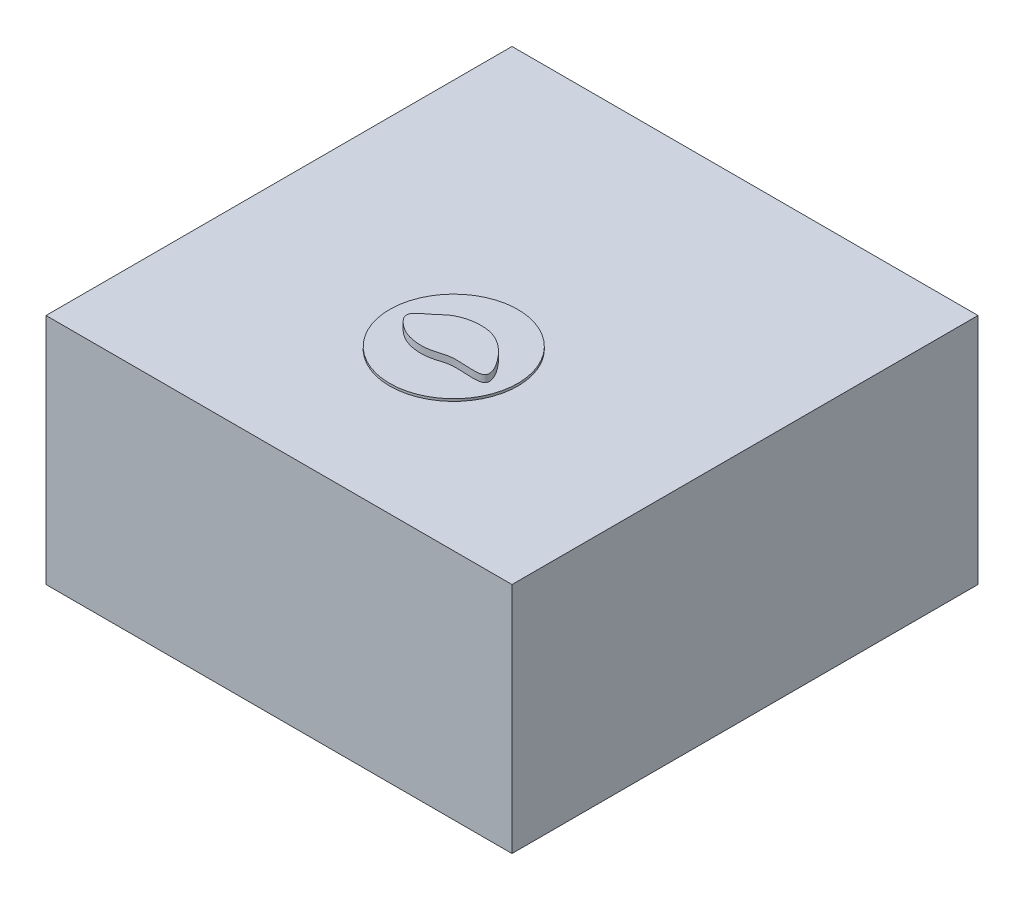
ISO-10303-21;
HEADER;
FILE_DESCRIPTION(('STEP AP214'),'2;1');
FILE_NAME('part.step','',(''),(''),'','','');
FILE_SCHEMA(('AUTOMOTIVE_DESIGN { 1 0 10303 214 1 1 1 1 }'));
ENDSEC;
DATA;
#1=APPLICATION_CONTEXT('core data for automotive mechanical design processes');
#2=APPLICATION_PROTOCOL_DEFINITION('international standard','automotive_design',2000,#1);
#3=PRODUCT_CONTEXT('',#1,'mechanical');
#4=PRODUCT('Part','Part','',(#3));
#5=PRODUCT_RELATED_PRODUCT_CATEGORY('part','',(#4));
#6=PRODUCT_DEFINITION_FORMATION('','',#4);
#7=PRODUCT_DEFINITION_CONTEXT('part definition',#1,'design');
#8=PRODUCT_DEFINITION('design','',#6,#7);
#9=PRODUCT_DEFINITION_SHAPE('','',#8);
#10=(LENGTH_UNIT() NAMED_UNIT(*) SI_UNIT(.MILLI.,.METRE.));
#11=(NAMED_UNIT(*) PLANE_ANGLE_UNIT() SI_UNIT($,.RADIAN.));
#12=(NAMED_UNIT(*) SI_UNIT($,.STERADIAN.) SOLID_ANGLE_UNIT());
#13=UNCERTAINTY_MEASURE_WITH_UNIT(LENGTH_MEASURE(1.E-05),#10,'distance_accuracy_value','');
#14=(GEOMETRIC_REPRESENTATION_CONTEXT(3) GLOBAL_UNCERTAINTY_ASSIGNED_CONTEXT((#13)) GLOBAL_UNIT_ASSIGNED_CONTEXT((#10,
#11,#12)) REPRESENTATION_CONTEXT('',''));
#15=CARTESIAN_POINT('',(0.,0.,0.));
#16=DIRECTION('',(0.,0.,1.));
#17=DIRECTION('',(1.,0.,0.));
#18=AXIS2_PLACEMENT_3D('',#15,#16,#17);
#19=CARTESIAN_POINT('',(-1.32978682457797,5.4,12.0470966404881));
#20=CARTESIAN_POINT('',(-1.56949938233388,5.4,12.2405123536894));
#21=CARTESIAN_POINT('',(-2.08614424851907,5.4,12.5391697720833));
#22=CARTESIAN_POINT('',(-1.58643209411403,5.4,13.1168891119311));
#23=CARTESIAN_POINT('',(-0.99479110722871,5.4,13.4609601521511));
#24=CARTESIAN_POINT('',(-0.122057096544853,5.4,13.5063472457396));
#25=CARTESIAN_POINT('',(0.780549472015395,5.4,13.1044677868928));
#26=CARTESIAN_POINT('',(2.65290980881673,5.4,13.5718372621998));
#27=CARTESIAN_POINT('',(1.37260667116618,5.4,11.7465735610997));
#28=CARTESIAN_POINT('',(0.251281573482777,5.4,11.3225744749199));
#29=CARTESIAN_POINT('',(-0.824147776626976,5.4,11.5489578340658));
#30=CARTESIAN_POINT('',(-1.19634203116918,5.4,11.9394246848268));
#31=CARTESIAN_POINT('',(-1.32978682457797,5.4,12.0470966404881));
#32=B_SPLINE_CURVE_WITH_KNOTS('',3,(#19,#20,#21,#22,#23,#24,#25,#26,#27,#28,#29,#30,#31),
.UNSPECIFIED.,.T.,.F.,(4,1,1,1,1,1,1,1,1,1,4),(0.,0.0890314863366276,0.133435272323839,
0.204833870138696,0.315562123210451,0.38661889368764,0.538438655581061,0.696738525235763,
0.817182112999442,0.95043735542146,1.),.UNSPECIFIED.);
#33=DIRECTION('',(0.,-1.,0.));
#34=VECTOR('',#33,1.);
#35=SURFACE_OF_LINEAR_EXTRUSION('',#32,#34);
#36=CARTESIAN_POINT('',(-1.32978682457797,5.4,12.0470966404881));
#37=VERTEX_POINT('',#36);
#38=EDGE_CURVE('E11',#37,#37,#32,.T.);
#39=ORIENTED_EDGE('',*,*,#38,.F.);
#40=EDGE_LOOP('',(#39));
#41=FACE_BOUND('',#40,.T.);
#42=CARTESIAN_POINT('',(-1.32978682457797,5.1,12.0470966404881));
#43=CARTESIAN_POINT('',(-1.56949938233388,5.1,12.2405123536894));
#44=CARTESIAN_POINT('',(-2.08614424851907,5.1,12.5391697720833));
#45=CARTESIAN_POINT('',(-1.58643209411403,5.1,13.1168891119311));
#46=CARTESIAN_POINT('',(-0.99479110722871,5.1,13.4609601521511));
#47=CARTESIAN_POINT('',(-0.122057096544853,5.1,13.5063472457396));
#48=CARTESIAN_POINT('',(0.780549472015395,5.1,13.1044677868928));
#49=CARTESIAN_POINT('',(2.65290980881673,5.1,13.5718372621998));
#50=CARTESIAN_POINT('',(1.37260667116618,5.1,11.7465735610997));
#51=CARTESIAN_POINT('',(0.251281573482777,5.1,11.3225744749199));
#52=CARTESIAN_POINT('',(-0.824147776626976,5.1,11.5489578340658));
#53=CARTESIAN_POINT('',(-1.19634203116918,5.1,11.9394246848268));
#54=CARTESIAN_POINT('',(-1.32978682457797,5.1,12.0470966404881));
#55=B_SPLINE_CURVE_WITH_KNOTS('',3,(#42,#43,#44,#45,#46,#47,#48,#49,#50,#51,#52,#53,#54),
.UNSPECIFIED.,.T.,.F.,(4,1,1,1,1,1,1,1,1,1,4),(0.,0.0890314863366276,0.133435272323839,
0.204833870138696,0.315562123210451,0.38661889368764,0.538438655581061,0.696738525235763,
0.817182112999442,0.95043735542146,1.),.UNSPECIFIED.);
#56=CARTESIAN_POINT('',(-1.32978682457797,5.1,12.0470966404881));
#57=VERTEX_POINT('',#56);
#58=EDGE_CURVE('E45',#57,#57,#55,.T.);
#59=ORIENTED_EDGE('',*,*,#58,.T.);
#60=EDGE_LOOP('',(#59));
#61=FACE_BOUND('',#60,.T.);
#62=ADVANCED_FACE('F41',(#41,#61),#35,.F.);
#63=CARTESIAN_POINT('',(1.81422588975815,5.4,13.257386496687));
#64=DIRECTION('',(0.,-1.,0.));
#65=DIRECTION('',(0.,0.,-1.));
#66=AXIS2_PLACEMENT_3D('',#63,#64,#65);
#67=PLANE('',#66);
#68=ORIENTED_EDGE('',*,*,#38,.T.);
#69=EDGE_LOOP('',(#68));
#70=FACE_BOUND('',#69,.T.);
#71=ADVANCED_FACE('F64',(#70),#67,.F.);
#72=CARTESIAN_POINT('',(1.81422588975815,5.1,13.257386496687));
#73=DIRECTION('',(0.,-1.,0.));
#74=DIRECTION('',(0.,0.,-1.));
#75=AXIS2_PLACEMENT_3D('',#72,#73,#74);
#76=PLANE('',#75);
#77=ORIENTED_EDGE('',*,*,#58,.F.);
#78=EDGE_LOOP('',(#77));
#79=FACE_BOUND('',#78,.T.);
#80=ADVANCED_FACE('F62',(#79),#76,.T.);
#81=CLOSED_SHELL('',(#62,#71,#80));
#82=MANIFOLD_SOLID_BREP('B2',#81);
#83=CARTESIAN_POINT('',(0.5,5.,12.5));
#84=DIRECTION('',(0.,1.,0.));
#85=DIRECTION('',(0.,0.,1.));
#86=AXIS2_PLACEMENT_3D('',#83,#84,#85);
#87=CYLINDRICAL_SURFACE('',#86,0.00500000000000103);
#88=CARTESIAN_POINT('',(0.5,5.,12.5));
#89=DIRECTION('',(0.,-1.,0.));
#90=DIRECTION('',(0.,0.,1.));
#91=AXIS2_PLACEMENT_3D('',#88,#89,#90);
#92=CIRCLE('',#91,0.00500000000000103);
#93=CARTESIAN_POINT('',(0.5,5.,12.505));
#94=VERTEX_POINT('',#93);
#95=EDGE_CURVE('E40',#94,#94,#92,.T.);
#96=ORIENTED_EDGE('',*,*,#95,.F.);
#97=EDGE_LOOP('',(#96));
#98=FACE_BOUND('',#97,.T.);
#99=CARTESIAN_POINT('',(0.5,5.1,12.5));
#100=DIRECTION('',(0.,-1.,0.));
#101=DIRECTION('',(0.,0.,1.));
#102=AXIS2_PLACEMENT_3D('',#99,#100,#101);
#103=CIRCLE('',#102,0.00500000000000103);
#104=CARTESIAN_POINT('',(0.5,5.1,12.505));
#105=VERTEX_POINT('',#104);
#106=EDGE_CURVE('E103',#105,#105,#103,.T.);
#107=ORIENTED_EDGE('',*,*,#106,.T.);
#108=EDGE_LOOP('',(#107));
#109=FACE_BOUND('',#108,.T.);
#110=ADVANCED_FACE('F100',(#98,#109),#87,.T.);
#111=CARTESIAN_POINT('',(0.5,5.,12.5));
#112=DIRECTION('',(0.,1.,0.));
#113=DIRECTION('',(0.,0.,1.));
#114=AXIS2_PLACEMENT_3D('',#111,#112,#113);
#115=PLANE('',#114);
#116=ORIENTED_EDGE('',*,*,#95,.T.);
#117=EDGE_LOOP('',(#116));
#118=FACE_BOUND('',#117,.T.);
#119=ADVANCED_FACE('F115',(#118),#115,.F.);
#120=CARTESIAN_POINT('',(0.5,5.1,12.5));
#121=DIRECTION('',(0.,1.,0.));
#122=DIRECTION('',(0.,0.,1.));
#123=AXIS2_PLACEMENT_3D('',#120,#121,#122);
#124=PLANE('',#123);
#125=ORIENTED_EDGE('',*,*,#106,.F.);
#126=EDGE_LOOP('',(#125));
#127=FACE_BOUND('',#126,.T.);
#128=ADVANCED_FACE('F113',(#127),#124,.T.);
#129=CLOSED_SHELL('',(#110,#119,#128));
#130=MANIFOLD_SOLID_BREP('B6',#129);
#131=CARTESIAN_POINT('',(0.499999999999998,5.,12.));
#132=DIRECTION('',(0.,1.,0.));
#133=DIRECTION('',(0.,0.,1.));
#134=AXIS2_PLACEMENT_3D('',#131,#132,#133);
#135=CYLINDRICAL_SURFACE('',#134,0.00499999999999896);
#136=CARTESIAN_POINT('',(0.499999999999998,5.,12.));
#137=DIRECTION('',(0.,-1.,0.));
#138=DIRECTION('',(0.,0.,1.));
#139=AXIS2_PLACEMENT_3D('',#136,#137,#138);
#140=CIRCLE('',#139,0.00499999999999896);
#141=CARTESIAN_POINT('',(0.499999999999998,5.,12.005));
#142=VERTEX_POINT('',#141);
#143=EDGE_CURVE('E99',#142,#142,#140,.T.);
#144=ORIENTED_EDGE('',*,*,#143,.F.);
#145=EDGE_LOOP('',(#144));
#146=FACE_BOUND('',#145,.T.);
#147=CARTESIAN_POINT('',(0.499999999999998,5.1,12.));
#148=DIRECTION('',(0.,-1.,0.));
#149=DIRECTION('',(0.,0.,1.));
#150=AXIS2_PLACEMENT_3D('',#147,#148,#149);
#151=CIRCLE('',#150,0.00499999999999896);
#152=CARTESIAN_POINT('',(0.499999999999998,5.1,12.005));
#153=VERTEX_POINT('',#152);
#154=EDGE_CURVE('E151',#153,#153,#151,.T.);
#155=ORIENTED_EDGE('',*,*,#154,.T.);
#156=EDGE_LOOP('',(#155));
#157=FACE_BOUND('',#156,.T.);
#158=ADVANCED_FACE('F148',(#146,#157),#135,.T.);
#159=CARTESIAN_POINT('',(0.499999999999998,5.,12.));
#160=DIRECTION('',(0.,1.,0.));
#161=DIRECTION('',(0.,0.,1.));
#162=AXIS2_PLACEMENT_3D('',#159,#160,#161);
#163=PLANE('',#162);
#164=ORIENTED_EDGE('',*,*,#143,.T.);
#165=EDGE_LOOP('',(#164));
#166=FACE_BOUND('',#165,.T.);
#167=ADVANCED_FACE('F163',(#166),#163,.F.);
#168=CARTESIAN_POINT('',(0.499999999999998,5.1,12.));
#169=DIRECTION('',(0.,1.,0.));
#170=DIRECTION('',(0.,0.,1.));
#171=AXIS2_PLACEMENT_3D('',#168,#169,#170);
#172=PLANE('',#171);
#173=ORIENTED_EDGE('',*,*,#154,.F.);
#174=EDGE_LOOP('',(#173));
#175=FACE_BOUND('',#174,.T.);
#176=ADVANCED_FACE('F161',(#175),#172,.T.);
#177=CLOSED_SHELL('',(#158,#167,#176));
#178=MANIFOLD_SOLID_BREP('B35',#177);
#179=CARTESIAN_POINT('',(0.499999999999998,5.,13.));
#180=DIRECTION('',(0.,1.,0.));
#181=DIRECTION('',(0.,0.,1.));
#182=AXIS2_PLACEMENT_3D('',#179,#180,#181);
#183=CYLINDRICAL_SURFACE('',#182,0.00500000000000103);
#184=CARTESIAN_POINT('',(0.499999999999998,5.,13.));
#185=DIRECTION('',(0.,-1.,0.));
#186=DIRECTION('',(0.,0.,-1.));
#187=AXIS2_PLACEMENT_3D('',#184,#185,#186);
#188=CIRCLE('',#187,0.00500000000000103);
#189=CARTESIAN_POINT('',(0.499999999999998,5.,12.995));
#190=VERTEX_POINT('',#189);
#191=EDGE_CURVE('E147',#190,#190,#188,.T.);
#192=ORIENTED_EDGE('',*,*,#191,.F.);
#193=EDGE_LOOP('',(#192));
#194=FACE_BOUND('',#193,.T.);
#195=CARTESIAN_POINT('',(0.499999999999998,5.1,13.));
#196=DIRECTION('',(0.,-1.,0.));
#197=DIRECTION('',(0.,0.,-1.));
#198=AXIS2_PLACEMENT_3D('',#195,#196,#197);
#199=CIRCLE('',#198,0.00500000000000103);
#200=CARTESIAN_POINT('',(0.499999999999998,5.1,12.995));
#201=VERTEX_POINT('',#200);
#202=EDGE_CURVE('E199',#201,#201,#199,.T.);
#203=ORIENTED_EDGE('',*,*,#202,.T.);
#204=EDGE_LOOP('',(#203));
#205=FACE_BOUND('',#204,.T.);
#206=ADVANCED_FACE('F196',(#194,#205),#183,.T.);
#207=CARTESIAN_POINT('',(0.499999999999998,5.,13.));
#208=DIRECTION('',(0.,-1.,0.));
#209=DIRECTION('',(0.,0.,-1.));
#210=AXIS2_PLACEMENT_3D('',#207,#208,#209);
#211=PLANE('',#210);
#212=ORIENTED_EDGE('',*,*,#191,.T.);
#213=EDGE_LOOP('',(#212));
#214=FACE_BOUND('',#213,.T.);
#215=ADVANCED_FACE('F211',(#214),#211,.T.);
#216=CARTESIAN_POINT('',(0.499999999999998,5.1,13.));
#217=DIRECTION('',(0.,-1.,0.));
#218=DIRECTION('',(0.,0.,-1.));
#219=AXIS2_PLACEMENT_3D('',#216,#217,#218);
#220=PLANE('',#219);
#221=ORIENTED_EDGE('',*,*,#202,.F.);
#222=EDGE_LOOP('',(#221));
#223=FACE_BOUND('',#222,.T.);
#224=ADVANCED_FACE('F209',(#223),#220,.F.);
#225=CLOSED_SHELL('',(#206,#215,#224));
#226=MANIFOLD_SOLID_BREP('B94',#225);
#227=CARTESIAN_POINT('',(0.,5.,13.));
#228=DIRECTION('',(0.,1.,0.));
#229=DIRECTION('',(0.,0.,1.));
#230=AXIS2_PLACEMENT_3D('',#227,#228,#229);
#231=CYLINDRICAL_SURFACE('',#230,0.00500000000000099);
#232=CARTESIAN_POINT('',(0.,5.,13.));
#233=DIRECTION('',(0.,-1.,0.));
#234=DIRECTION('',(0.,0.,1.));
#235=AXIS2_PLACEMENT_3D('',#232,#233,#234);
#236=CIRCLE('',#235,0.00500000000000099);
#237=CARTESIAN_POINT('',(0.,5.,13.005));
#238=VERTEX_POINT('',#237);
#239=EDGE_CURVE('E195',#238,#238,#236,.T.);
#240=ORIENTED_EDGE('',*,*,#239,.F.);
#241=EDGE_LOOP('',(#240));
#242=FACE_BOUND('',#241,.T.);
#243=CARTESIAN_POINT('',(0.,5.1,13.));
#244=DIRECTION('',(0.,-1.,0.));
#245=DIRECTION('',(0.,0.,1.));
#246=AXIS2_PLACEMENT_3D('',#243,#244,#245);
#247=CIRCLE('',#246,0.00500000000000099);
#248=CARTESIAN_POINT('',(0.,5.1,13.005));
#249=VERTEX_POINT('',#248);
#250=EDGE_CURVE('E247',#249,#249,#247,.T.);
#251=ORIENTED_EDGE('',*,*,#250,.T.);
#252=EDGE_LOOP('',(#251));
#253=FACE_BOUND('',#252,.T.);
#254=ADVANCED_FACE('F244',(#242,#253),#231,.T.);
#255=CARTESIAN_POINT('',(0.,5.,13.));
#256=DIRECTION('',(0.,1.,0.));
#257=DIRECTION('',(0.,0.,1.));
#258=AXIS2_PLACEMENT_3D('',#255,#256,#257);
#259=PLANE('',#258);
#260=ORIENTED_EDGE('',*,*,#239,.T.);
#261=EDGE_LOOP('',(#260));
#262=FACE_BOUND('',#261,.T.);
#263=ADVANCED_FACE('F259',(#262),#259,.F.);
#264=CARTESIAN_POINT('',(0.,5.1,13.));
#265=DIRECTION('',(0.,1.,0.));
#266=DIRECTION('',(0.,0.,1.));
#267=AXIS2_PLACEMENT_3D('',#264,#265,#266);
#268=PLANE('',#267);
#269=ORIENTED_EDGE('',*,*,#250,.F.);
#270=EDGE_LOOP('',(#269));
#271=FACE_BOUND('',#270,.T.);
#272=ADVANCED_FACE('F257',(#271),#268,.T.);
#273=CLOSED_SHELL('',(#254,#263,#272));
#274=MANIFOLD_SOLID_BREP('B142',#273);
#275=CARTESIAN_POINT('',(-0.499999999999998,5.,13.));
#276=DIRECTION('',(0.,1.,0.));
#277=DIRECTION('',(0.,0.,1.));
#278=AXIS2_PLACEMENT_3D('',#275,#276,#277);
#279=CYLINDRICAL_SURFACE('',#278,0.00500000000000103);
#280=CARTESIAN_POINT('',(-0.499999999999998,5.,13.));
#281=DIRECTION('',(0.,-1.,0.));
#282=DIRECTION('',(0.,0.,1.));
#283=AXIS2_PLACEMENT_3D('',#280,#281,#282);
#284=CIRCLE('',#283,0.00500000000000103);
#285=CARTESIAN_POINT('',(-0.499999999999998,5.,13.005));
#286=VERTEX_POINT('',#285);
#287=EDGE_CURVE('E243',#286,#286,#284,.T.);
#288=ORIENTED_EDGE('',*,*,#287,.F.);
#289=EDGE_LOOP('',(#288));
#290=FACE_BOUND('',#289,.T.);
#291=CARTESIAN_POINT('',(-0.499999999999998,5.1,13.));
#292=DIRECTION('',(0.,-1.,0.));
#293=DIRECTION('',(0.,0.,1.));
#294=AXIS2_PLACEMENT_3D('',#291,#292,#293);
#295=CIRCLE('',#294,0.00500000000000103);
#296=CARTESIAN_POINT('',(-0.499999999999998,5.1,13.005));
#297=VERTEX_POINT('',#296);
#298=EDGE_CURVE('E295',#297,#297,#295,.T.);
#299=ORIENTED_EDGE('',*,*,#298,.T.);
#300=EDGE_LOOP('',(#299));
#301=FACE_BOUND('',#300,.T.);
#302=ADVANCED_FACE('F292',(#290,#301),#279,.T.);
#303=CARTESIAN_POINT('',(-0.499999999999998,5.,13.));
#304=DIRECTION('',(0.,1.,0.));
#305=DIRECTION('',(0.,0.,1.));
#306=AXIS2_PLACEMENT_3D('',#303,#304,#305);
#307=PLANE('',#306);
#308=ORIENTED_EDGE('',*,*,#287,.T.);
#309=EDGE_LOOP('',(#308));
#310=FACE_BOUND('',#309,.T.);
#311=ADVANCED_FACE('F307',(#310),#307,.F.);
#312=CARTESIAN_POINT('',(-0.499999999999998,5.1,13.));
#313=DIRECTION('',(0.,1.,0.));
#314=DIRECTION('',(0.,0.,1.));
#315=AXIS2_PLACEMENT_3D('',#312,#313,#314);
#316=PLANE('',#315);
#317=ORIENTED_EDGE('',*,*,#298,.F.);
#318=EDGE_LOOP('',(#317));
#319=FACE_BOUND('',#318,.T.);
#320=ADVANCED_FACE('F305',(#319),#316,.T.);
#321=CLOSED_SHELL('',(#302,#311,#320));
#322=MANIFOLD_SOLID_BREP('B190',#321);
#323=CARTESIAN_POINT('',(0.,5.,12.));
#324=DIRECTION('',(0.,1.,0.));
#325=DIRECTION('',(0.,0.,1.));
#326=AXIS2_PLACEMENT_3D('',#323,#324,#325);
#327=CYLINDRICAL_SURFACE('',#326,0.00499999999999898);
#328=CARTESIAN_POINT('',(0.,5.,12.));
#329=DIRECTION('',(0.,-1.,0.));
#330=DIRECTION('',(0.,0.,-1.));
#331=AXIS2_PLACEMENT_3D('',#328,#329,#330);
#332=CIRCLE('',#331,0.00499999999999898);
#333=CARTESIAN_POINT('',(0.,5.,11.995));
#334=VERTEX_POINT('',#333);
#335=EDGE_CURVE('E291',#334,#334,#332,.T.);
#336=ORIENTED_EDGE('',*,*,#335,.F.);
#337=EDGE_LOOP('',(#336));
#338=FACE_BOUND('',#337,.T.);
#339=CARTESIAN_POINT('',(0.,5.1,12.));
#340=DIRECTION('',(0.,-1.,0.));
#341=DIRECTION('',(0.,0.,-1.));
#342=AXIS2_PLACEMENT_3D('',#339,#340,#341);
#343=CIRCLE('',#342,0.00499999999999898);
#344=CARTESIAN_POINT('',(0.,5.1,11.995));
#345=VERTEX_POINT('',#344);
#346=EDGE_CURVE('E343',#345,#345,#343,.T.);
#347=ORIENTED_EDGE('',*,*,#346,.T.);
#348=EDGE_LOOP('',(#347));
#349=FACE_BOUND('',#348,.T.);
#350=ADVANCED_FACE('F340',(#338,#349),#327,.T.);
#351=CARTESIAN_POINT('',(0.,5.,12.));
#352=DIRECTION('',(0.,-1.,0.));
#353=DIRECTION('',(0.,0.,-1.));
#354=AXIS2_PLACEMENT_3D('',#351,#352,#353);
#355=PLANE('',#354);
#356=ORIENTED_EDGE('',*,*,#335,.T.);
#357=EDGE_LOOP('',(#356));
#358=FACE_BOUND('',#357,.T.);
#359=ADVANCED_FACE('F355',(#358),#355,.T.);
#360=CARTESIAN_POINT('',(0.,5.1,12.));
#361=DIRECTION('',(0.,-1.,0.));
#362=DIRECTION('',(0.,0.,-1.));
#363=AXIS2_PLACEMENT_3D('',#360,#361,#362);
#364=PLANE('',#363);
#365=ORIENTED_EDGE('',*,*,#346,.F.);
#366=EDGE_LOOP('',(#365));
#367=FACE_BOUND('',#366,.T.);
#368=ADVANCED_FACE('F353',(#367),#364,.F.);
#369=CLOSED_SHELL('',(#350,#359,#368));
#370=MANIFOLD_SOLID_BREP('B238',#369);
#371=CARTESIAN_POINT('',(-0.499999999999998,5.,12.));
#372=DIRECTION('',(0.,1.,0.));
#373=DIRECTION('',(0.,0.,1.));
#374=AXIS2_PLACEMENT_3D('',#371,#372,#373);
#375=CYLINDRICAL_SURFACE('',#374,0.00499999999999896);
#376=CARTESIAN_POINT('',(-0.499999999999998,5.,12.));
#377=DIRECTION('',(0.,-1.,0.));
#378=DIRECTION('',(0.,0.,-1.));
#379=AXIS2_PLACEMENT_3D('',#376,#377,#378);
#380=CIRCLE('',#379,0.00499999999999896);
#381=CARTESIAN_POINT('',(-0.499999999999998,5.,11.995));
#382=VERTEX_POINT('',#381);
#383=EDGE_CURVE('E339',#382,#382,#380,.T.);
#384=ORIENTED_EDGE('',*,*,#383,.F.);
#385=EDGE_LOOP('',(#384));
#386=FACE_BOUND('',#385,.T.);
#387=CARTESIAN_POINT('',(-0.499999999999998,5.1,12.));
#388=DIRECTION('',(0.,-1.,0.));
#389=DIRECTION('',(0.,0.,-1.));
#390=AXIS2_PLACEMENT_3D('',#387,#388,#389);
#391=CIRCLE('',#390,0.00499999999999896);
#392=CARTESIAN_POINT('',(-0.499999999999998,5.1,11.995));
#393=VERTEX_POINT('',#392);
#394=EDGE_CURVE('E391',#393,#393,#391,.T.);
#395=ORIENTED_EDGE('',*,*,#394,.T.);
#396=EDGE_LOOP('',(#395));
#397=FACE_BOUND('',#396,.T.);
#398=ADVANCED_FACE('F388',(#386,#397),#375,.T.);
#399=CARTESIAN_POINT('',(-0.499999999999998,5.,12.));
#400=DIRECTION('',(0.,-1.,0.));
#401=DIRECTION('',(0.,0.,-1.));
#402=AXIS2_PLACEMENT_3D('',#399,#400,#401);
#403=PLANE('',#402);
#404=ORIENTED_EDGE('',*,*,#383,.T.);
#405=EDGE_LOOP('',(#404));
#406=FACE_BOUND('',#405,.T.);
#407=ADVANCED_FACE('F403',(#406),#403,.T.);
#408=CARTESIAN_POINT('',(-0.499999999999998,5.1,12.));
#409=DIRECTION('',(0.,-1.,0.));
#410=DIRECTION('',(0.,0.,-1.));
#411=AXIS2_PLACEMENT_3D('',#408,#409,#410);
#412=PLANE('',#411);
#413=ORIENTED_EDGE('',*,*,#394,.F.);
#414=EDGE_LOOP('',(#413));
#415=FACE_BOUND('',#414,.T.);
#416=ADVANCED_FACE('F401',(#415),#412,.F.);
#417=CLOSED_SHELL('',(#398,#407,#416));
#418=MANIFOLD_SOLID_BREP('B286',#417);
#419=CARTESIAN_POINT('',(-0.5,5.,12.5));
#420=DIRECTION('',(0.,1.,0.));
#421=DIRECTION('',(0.,0.,1.));
#422=AXIS2_PLACEMENT_3D('',#419,#420,#421);
#423=CYLINDRICAL_SURFACE('',#422,0.00500000000000103);
#424=CARTESIAN_POINT('',(-0.5,5.,12.5));
#425=DIRECTION('',(0.,-1.,0.));
#426=DIRECTION('',(0.,0.,-1.));
#427=AXIS2_PLACEMENT_3D('',#424,#425,#426);
#428=CIRCLE('',#427,0.00500000000000103);
#429=CARTESIAN_POINT('',(-0.5,5.,12.495));
#430=VERTEX_POINT('',#429);
#431=EDGE_CURVE('E387',#430,#430,#428,.T.);
#432=ORIENTED_EDGE('',*,*,#431,.F.);
#433=EDGE_LOOP('',(#432));
#434=FACE_BOUND('',#433,.T.);
#435=CARTESIAN_POINT('',(-0.5,5.1,12.5));
#436=DIRECTION('',(0.,-1.,0.));
#437=DIRECTION('',(0.,0.,-1.));
#438=AXIS2_PLACEMENT_3D('',#435,#436,#437);
#439=CIRCLE('',#438,0.00500000000000103);
#440=CARTESIAN_POINT('',(-0.5,5.1,12.495));
#441=VERTEX_POINT('',#440);
#442=EDGE_CURVE('E439',#441,#441,#439,.T.);
#443=ORIENTED_EDGE('',*,*,#442,.T.);
#444=EDGE_LOOP('',(#443));
#445=FACE_BOUND('',#444,.T.);
#446=ADVANCED_FACE('F436',(#434,#445),#423,.T.);
#447=CARTESIAN_POINT('',(-0.5,5.,12.5));
#448=DIRECTION('',(0.,-1.,0.));
#449=DIRECTION('',(0.,0.,-1.));
#450=AXIS2_PLACEMENT_3D('',#447,#448,#449);
#451=PLANE('',#450);
#452=ORIENTED_EDGE('',*,*,#431,.T.);
#453=EDGE_LOOP('',(#452));
#454=FACE_BOUND('',#453,.T.);
#455=ADVANCED_FACE('F451',(#454),#451,.T.);
#456=CARTESIAN_POINT('',(-0.5,5.1,12.5));
#457=DIRECTION('',(0.,-1.,0.));
#458=DIRECTION('',(0.,0.,-1.));
#459=AXIS2_PLACEMENT_3D('',#456,#457,#458);
#460=PLANE('',#459);
#461=ORIENTED_EDGE('',*,*,#442,.F.);
#462=EDGE_LOOP('',(#461));
#463=FACE_BOUND('',#462,.T.);
#464=ADVANCED_FACE('F449',(#463),#460,.F.);
#465=CLOSED_SHELL('',(#446,#455,#464));
#466=MANIFOLD_SOLID_BREP('B334',#465);
#467=CARTESIAN_POINT('',(0.,5.,12.5));
#468=DIRECTION('',(0.,1.,0.));
#469=DIRECTION('',(0.,0.,1.));
#470=AXIS2_PLACEMENT_3D('',#467,#468,#469);
#471=CYLINDRICAL_SURFACE('',#470,0.00500000000000099);
#472=CARTESIAN_POINT('',(0.,5.,12.5));
#473=DIRECTION('',(0.,-1.,0.));
#474=DIRECTION('',(0.,0.,-1.));
#475=AXIS2_PLACEMENT_3D('',#472,#473,#474);
#476=CIRCLE('',#475,0.00500000000000099);
#477=CARTESIAN_POINT('',(0.,5.,12.495));
#478=VERTEX_POINT('',#477);
#479=EDGE_CURVE('E435',#478,#478,#476,.T.);
#480=ORIENTED_EDGE('',*,*,#479,.F.);
#481=EDGE_LOOP('',(#480));
#482=FACE_BOUND('',#481,.T.);
#483=CARTESIAN_POINT('',(0.,5.1,12.5));
#484=DIRECTION('',(0.,-1.,0.));
#485=DIRECTION('',(0.,0.,-1.));
#486=AXIS2_PLACEMENT_3D('',#483,#484,#485);
#487=CIRCLE('',#486,0.00500000000000099);
#488=CARTESIAN_POINT('',(0.,5.1,12.495));
#489=VERTEX_POINT('',#488);
#490=EDGE_CURVE('E487',#489,#489,#487,.T.);
#491=ORIENTED_EDGE('',*,*,#490,.T.);
#492=EDGE_LOOP('',(#491));
#493=FACE_BOUND('',#492,.T.);
#494=ADVANCED_FACE('F484',(#482,#493),#471,.T.);
#495=CARTESIAN_POINT('',(0.,5.,12.5));
#496=DIRECTION('',(0.,-1.,0.));
#497=DIRECTION('',(0.,0.,-1.));
#498=AXIS2_PLACEMENT_3D('',#495,#496,#497);
#499=PLANE('',#498);
#500=ORIENTED_EDGE('',*,*,#479,.T.);
#501=EDGE_LOOP('',(#500));
#502=FACE_BOUND('',#501,.T.);
#503=ADVANCED_FACE('F499',(#502),#499,.T.);
#504=CARTESIAN_POINT('',(0.,5.1,12.5));
#505=DIRECTION('',(0.,-1.,0.));
#506=DIRECTION('',(0.,0.,-1.));
#507=AXIS2_PLACEMENT_3D('',#504,#505,#506);
#508=PLANE('',#507);
#509=ORIENTED_EDGE('',*,*,#490,.F.);
#510=EDGE_LOOP('',(#509));
#511=FACE_BOUND('',#510,.T.);
#512=ADVANCED_FACE('F497',(#511),#508,.F.);
#513=CLOSED_SHELL('',(#494,#503,#512));
#514=MANIFOLD_SOLID_BREP('B382',#513);
#515=CARTESIAN_POINT('',(0.,5.1,12.5));
#516=DIRECTION('',(0.,-1.,0.));
#517=DIRECTION('',(0.,0.,-1.));
#518=AXIS2_PLACEMENT_3D('',#515,#516,#517);
#519=CYLINDRICAL_SURFACE('',#518,2.75);
#520=CARTESIAN_POINT('',(0.,5.1,12.5));
#521=DIRECTION('',(0.,1.,0.));
#522=DIRECTION('',(0.,0.,1.));
#523=AXIS2_PLACEMENT_3D('',#520,#521,#522);
#524=CIRCLE('',#523,2.75);
#525=CARTESIAN_POINT('',(0.,5.1,15.25));
#526=VERTEX_POINT('',#525);
#527=EDGE_CURVE('E483',#526,#526,#524,.T.);
#528=ORIENTED_EDGE('',*,*,#527,.F.);
#529=EDGE_LOOP('',(#528));
#530=FACE_BOUND('',#529,.T.);
#531=CARTESIAN_POINT('',(0.,5.,12.5));
#532=DIRECTION('',(0.,1.,0.));
#533=DIRECTION('',(0.,0.,1.));
#534=AXIS2_PLACEMENT_3D('',#531,#532,#533);
#535=CIRCLE('',#534,2.75);
#536=CARTESIAN_POINT('',(0.,5.,15.25));
#537=VERTEX_POINT('',#536);
#538=EDGE_CURVE('E535',#537,#537,#535,.T.);
#539=ORIENTED_EDGE('',*,*,#538,.T.);
#540=EDGE_LOOP('',(#539));
#541=FACE_BOUND('',#540,.T.);
#542=ADVANCED_FACE('F532',(#530,#541),#519,.T.);
#543=CARTESIAN_POINT('',(0.,5.1,12.5));
#544=DIRECTION('',(0.,1.,0.));
#545=DIRECTION('',(0.,0.,1.));
#546=AXIS2_PLACEMENT_3D('',#543,#544,#545);
#547=PLANE('',#546);
#548=ORIENTED_EDGE('',*,*,#527,.T.);
#549=EDGE_LOOP('',(#548));
#550=FACE_BOUND('',#549,.T.);
#551=ADVANCED_FACE('F547',(#550),#547,.T.);
#552=CARTESIAN_POINT('',(0.,5.,12.5));
#553=DIRECTION('',(0.,1.,0.));
#554=DIRECTION('',(0.,0.,1.));
#555=AXIS2_PLACEMENT_3D('',#552,#553,#554);
#556=PLANE('',#555);
#557=ORIENTED_EDGE('',*,*,#538,.F.);
#558=EDGE_LOOP('',(#557));
#559=FACE_BOUND('',#558,.T.);
#560=ADVANCED_FACE('F545',(#559),#556,.F.);
#561=CLOSED_SHELL('',(#542,#551,#560));
#562=MANIFOLD_SOLID_BREP('B430',#561);
#563=CARTESIAN_POINT('',(7.5,4.,20.));
#564=DIRECTION('',(0.,0.,-1.));
#565=DIRECTION('',(-1.,0.,0.));
#566=AXIS2_PLACEMENT_3D('',#563,#564,#565);
#567=PLANE('',#566);
#568=CARTESIAN_POINT('',(7.5,4.,20.));
#569=DIRECTION('',(0.,0.,1.));
#570=DIRECTION('',(-1.,0.,0.));
#571=AXIS2_PLACEMENT_3D('',#568,#569,#570);
#572=CIRCLE('',#571,0.500000000000004);
#573=CARTESIAN_POINT('',(6.99999999999999,4.,20.));
#574=VERTEX_POINT('',#573);
#575=EDGE_CURVE('E590',#574,#574,#572,.T.);
#576=ORIENTED_EDGE('',*,*,#575,.T.);
#577=EDGE_LOOP('',(#576));
#578=FACE_BOUND('',#577,.T.);
#579=ADVANCED_FACE('F580',(#578),#567,.F.);
#580=CARTESIAN_POINT('',(7.5,5.,4.));
#581=DIRECTION('',(0.,1.,0.));
#582=DIRECTION('',(-1.,0.,0.));
#583=AXIS2_PLACEMENT_3D('',#580,#581,#582);
#584=PLANE('',#583);
#585=CARTESIAN_POINT('',(7.5,5.,4.));
#586=DIRECTION('',(0.,-1.,0.));
#587=DIRECTION('',(-1.,0.,0.));
#588=AXIS2_PLACEMENT_3D('',#585,#586,#587);
#589=CIRCLE('',#588,0.500000000000004);
#590=CARTESIAN_POINT('',(7.5,5.,3.5));
#591=VERTEX_POINT('',#590);
#592=EDGE_CURVE('E531',#591,#591,#589,.T.);
#593=ORIENTED_EDGE('',*,*,#592,.F.);
#594=EDGE_LOOP('',(#593));
#595=FACE_BOUND('',#594,.T.);
#596=ADVANCED_FACE('F601',(#595),#584,.T.);
#597=CARTESIAN_POINT('',(7.5,4.,20.));
#598=DIRECTION('',(0.,0.,-1.));
#599=DIRECTION('',(-1.,0.,0.));
#600=AXIS2_PLACEMENT_3D('',#597,#598,#599);
#601=CYLINDRICAL_SURFACE('',#600,0.500000000000004);
#602=CARTESIAN_POINT('',(7.5,4.,5.));
#603=DIRECTION('',(0.,0.,1.));
#604=DIRECTION('',(-1.,0.,0.));
#605=AXIS2_PLACEMENT_3D('',#602,#603,#604);
#606=CIRCLE('',#605,0.500000000000004);
#607=CARTESIAN_POINT('',(7.5,3.5,5.));
#608=VERTEX_POINT('',#607);
#609=EDGE_CURVE('E586',#608,#608,#606,.T.);
#610=ORIENTED_EDGE('',*,*,#609,.T.);
#611=EDGE_LOOP('',(#610));
#612=FACE_BOUND('',#611,.T.);
#613=ORIENTED_EDGE('',*,*,#575,.F.);
#614=EDGE_LOOP('',(#613));
#615=FACE_BOUND('',#614,.T.);
#616=ADVANCED_FACE('F598',(#612,#615),#601,.T.);
#617=CARTESIAN_POINT('',(7.5,5.,5.));
#618=DIRECTION('',(1.,0.,0.));
#619=DIRECTION('',(0.,0.,-1.));
#620=AXIS2_PLACEMENT_3D('',#617,#618,#619);
#621=TOROIDAL_SURFACE('',#620,0.999999999999998,0.500000000000004);
#622=CARTESIAN_POINT('',(7.5,5.,5.));
#623=DIRECTION('',(1.,0.,0.));
#624=DIRECTION('',(0.,0.,-1.));
#625=AXIS2_PLACEMENT_3D('',#622,#623,#624);
#626=CIRCLE('',#625,1.5);
#627=EDGE_CURVE('',#608,#591,#626,.T.);
#628=ORIENTED_EDGE('',*,*,#609,.F.);
#629=ORIENTED_EDGE('',*,*,#592,.T.);
#630=ORIENTED_EDGE('',*,*,#627,.T.);
#631=ORIENTED_EDGE('',*,*,#627,.F.);
#632=EDGE_LOOP('',(#628,#630,#629,#631));
#633=FACE_BOUND('',#632,.T.);
#634=ADVANCED_FACE('F600',(#633),#621,.T.);
#635=CLOSED_SHELL('',(#579,#596,#616,#634));
#636=MANIFOLD_SOLID_BREP('B478',#635);
#637=CARTESIAN_POINT('',(-7.5,4.,20.));
#638=DIRECTION('',(0.,0.,1.));
#639=DIRECTION('',(1.,0.,0.));
#640=AXIS2_PLACEMENT_3D('',#637,#638,#639);
#641=PLANE('',#640);
#642=CARTESIAN_POINT('',(-7.5,4.,20.));
#643=DIRECTION('',(0.,0.,1.));
#644=DIRECTION('',(1.,0.,0.));
#645=AXIS2_PLACEMENT_3D('',#642,#643,#644);
#646=CIRCLE('',#645,0.500000000000002);
#647=CARTESIAN_POINT('',(-7.,4.,20.));
#648=VERTEX_POINT('',#647);
#649=EDGE_CURVE('E654',#648,#648,#646,.T.);
#650=ORIENTED_EDGE('',*,*,#649,.T.);
#651=EDGE_LOOP('',(#650));
#652=FACE_BOUND('',#651,.T.);
#653=ADVANCED_FACE('F644',(#652),#641,.T.);
#654=CARTESIAN_POINT('',(-7.5,5.,4.));
#655=DIRECTION('',(0.,-1.,0.));
#656=DIRECTION('',(1.,0.,0.));
#657=AXIS2_PLACEMENT_3D('',#654,#655,#656);
#658=PLANE('',#657);
#659=CARTESIAN_POINT('',(-7.5,5.,4.));
#660=DIRECTION('',(0.,-1.,0.));
#661=DIRECTION('',(1.,0.,0.));
#662=AXIS2_PLACEMENT_3D('',#659,#660,#661);
#663=CIRCLE('',#662,0.500000000000002);
#664=CARTESIAN_POINT('',(-7.5,5.,3.5));
#665=VERTEX_POINT('',#664);
#666=EDGE_CURVE('E579',#665,#665,#663,.T.);
#667=ORIENTED_EDGE('',*,*,#666,.F.);
#668=EDGE_LOOP('',(#667));
#669=FACE_BOUND('',#668,.T.);
#670=ADVANCED_FACE('F665',(#669),#658,.F.);
#671=CARTESIAN_POINT('',(-7.5,4.,20.));
#672=DIRECTION('',(0.,0.,-1.));
#673=DIRECTION('',(-1.,0.,0.));
#674=AXIS2_PLACEMENT_3D('',#671,#672,#673);
#675=CYLINDRICAL_SURFACE('',#674,0.500000000000002);
#676=CARTESIAN_POINT('',(-7.5,4.,5.));
#677=DIRECTION('',(0.,0.,1.));
#678=DIRECTION('',(1.,0.,0.));
#679=AXIS2_PLACEMENT_3D('',#676,#677,#678);
#680=CIRCLE('',#679,0.500000000000002);
#681=CARTESIAN_POINT('',(-7.5,3.5,5.));
#682=VERTEX_POINT('',#681);
#683=EDGE_CURVE('E650',#682,#682,#680,.T.);
#684=ORIENTED_EDGE('',*,*,#683,.T.);
#685=EDGE_LOOP('',(#684));
#686=FACE_BOUND('',#685,.T.);
#687=ORIENTED_EDGE('',*,*,#649,.F.);
#688=EDGE_LOOP('',(#687));
#689=FACE_BOUND('',#688,.T.);
#690=ADVANCED_FACE('F662',(#686,#689),#675,.T.);
#691=CARTESIAN_POINT('',(-7.5,5.,5.));
#692=DIRECTION('',(1.,0.,0.));
#693=DIRECTION('',(0.,0.,-1.));
#694=AXIS2_PLACEMENT_3D('',#691,#692,#693);
#695=TOROIDAL_SURFACE('',#694,1.,0.500000000000002);
#696=CARTESIAN_POINT('',(-7.5,5.,5.));
#697=DIRECTION('',(1.,0.,0.));
#698=DIRECTION('',(0.,0.,-1.));
#699=AXIS2_PLACEMENT_3D('',#696,#697,#698);
#700=CIRCLE('',#699,1.5);
#701=EDGE_CURVE('',#682,#665,#700,.T.);
#702=ORIENTED_EDGE('',*,*,#683,.F.);
#703=ORIENTED_EDGE('',*,*,#666,.T.);
#704=ORIENTED_EDGE('',*,*,#701,.T.);
#705=ORIENTED_EDGE('',*,*,#701,.F.);
#706=EDGE_LOOP('',(#702,#704,#703,#705));
#707=FACE_BOUND('',#706,.T.);
#708=ADVANCED_FACE('F664',(#707),#695,.T.);
#709=CLOSED_SHELL('',(#653,#670,#690,#708));
#710=MANIFOLD_SOLID_BREP('B526',#709);
#711=CARTESIAN_POINT('',(10.,-5.,20.));
#712=DIRECTION('',(-1.,0.,0.));
#713=DIRECTION('',(0.,0.,1.));
#714=AXIS2_PLACEMENT_3D('',#711,#712,#713);
#715=PLANE('',#714);
#716=DIRECTION('',(0.,1.,0.));
#717=VECTOR('',#716,1.);
#718=CARTESIAN_POINT('',(10.,-5.,0.));
#719=LINE('',#718,#717);
#720=CARTESIAN_POINT('',(10.,-5.,0.));
#721=VERTEX_POINT('',#720);
#722=CARTESIAN_POINT('',(10.,5.,0.));
#723=VERTEX_POINT('',#722);
#724=EDGE_CURVE('E762',#721,#723,#719,.T.);
#725=ORIENTED_EDGE('',*,*,#724,.T.);
#726=DIRECTION('',(0.,0.,-1.));
#727=VECTOR('',#726,1.);
#728=CARTESIAN_POINT('',(10.,5.,20.));
#729=LINE('',#728,#727);
#730=CARTESIAN_POINT('',(10.,5.,20.));
#731=VERTEX_POINT('',#730);
#732=EDGE_CURVE('E642',#731,#723,#729,.T.);
#733=ORIENTED_EDGE('',*,*,#732,.F.);
#734=DIRECTION('',(0.,1.,0.));
#735=VECTOR('',#734,1.);
#736=CARTESIAN_POINT('',(10.,-5.,20.));
#737=LINE('',#736,#735);
#738=CARTESIAN_POINT('',(10.,-5.,20.));
#739=VERTEX_POINT('',#738);
#740=EDGE_CURVE('E750',#739,#731,#737,.T.);
#741=ORIENTED_EDGE('',*,*,#740,.F.);
#742=DIRECTION('',(0.,0.,-1.));
#743=VECTOR('',#742,1.);
#744=CARTESIAN_POINT('',(10.,-5.,20.));
#745=LINE('',#744,#743);
#746=EDGE_CURVE('E758',#739,#721,#745,.T.);
#747=ORIENTED_EDGE('',*,*,#746,.T.);
#748=EDGE_LOOP('',(#725,#733,#741,#747));
#749=FACE_BOUND('',#748,.T.);
#750=ADVANCED_FACE('F699',(#749),#715,.F.);
#751=CARTESIAN_POINT('',(-10.,5.,20.));
#752=DIRECTION('',(0.,-1.,0.));
#753=DIRECTION('',(0.,0.,-1.));
#754=AXIS2_PLACEMENT_3D('',#751,#752,#753);
#755=PLANE('',#754);
#756=DIRECTION('',(-1.,0.,0.));
#757=VECTOR('',#756,1.);
#758=CARTESIAN_POINT('',(-10.,5.,0.));
#759=LINE('',#758,#757);
#760=CARTESIAN_POINT('',(-10.,5.,0.));
#761=VERTEX_POINT('',#760);
#762=EDGE_CURVE('E754',#723,#761,#759,.T.);
#763=ORIENTED_EDGE('',*,*,#762,.T.);
#764=DIRECTION('',(0.,0.,-1.));
#765=VECTOR('',#764,1.);
#766=CARTESIAN_POINT('',(-10.,5.,20.));
#767=LINE('',#766,#765);
#768=CARTESIAN_POINT('',(-10.,5.,20.));
#769=VERTEX_POINT('',#768);
#770=EDGE_CURVE('E707',#769,#761,#767,.T.);
#771=ORIENTED_EDGE('',*,*,#770,.F.);
#772=DIRECTION('',(-1.,0.,0.));
#773=VECTOR('',#772,1.);
#774=CARTESIAN_POINT('',(-10.,5.,20.));
#775=LINE('',#774,#773);
#776=EDGE_CURVE('E745',#731,#769,#775,.T.);
#777=ORIENTED_EDGE('',*,*,#776,.F.);
#778=ORIENTED_EDGE('',*,*,#732,.T.);
#779=EDGE_LOOP('',(#763,#771,#777,#778));
#780=FACE_BOUND('',#779,.T.);
#781=ADVANCED_FACE('F753',(#780),#755,.F.);
#782=CARTESIAN_POINT('',(-10.,-5.,20.));
#783=DIRECTION('',(1.,0.,0.));
#784=DIRECTION('',(0.,1.,0.));
#785=AXIS2_PLACEMENT_3D('',#782,#783,#784);
#786=PLANE('',#785);
#787=DIRECTION('',(0.,-1.,0.));
#788=VECTOR('',#787,1.);
#789=CARTESIAN_POINT('',(-10.,-5.,0.));
#790=LINE('',#789,#788);
#791=CARTESIAN_POINT('',(-10.,-5.,0.));
#792=VERTEX_POINT('',#791);
#793=EDGE_CURVE('E732',#761,#792,#790,.T.);
#794=ORIENTED_EDGE('',*,*,#793,.T.);
#795=DIRECTION('',(0.,0.,-1.));
#796=VECTOR('',#795,1.);
#797=CARTESIAN_POINT('',(-10.,-5.,20.));
#798=LINE('',#797,#796);
#799=CARTESIAN_POINT('',(-10.,-5.,20.));
#800=VERTEX_POINT('',#799);
#801=EDGE_CURVE('E755',#800,#792,#798,.T.);
#802=ORIENTED_EDGE('',*,*,#801,.F.);
#803=DIRECTION('',(0.,-1.,0.));
#804=VECTOR('',#803,1.);
#805=CARTESIAN_POINT('',(-10.,-5.,20.));
#806=LINE('',#805,#804);
#807=EDGE_CURVE('E748',#769,#800,#806,.T.);
#808=ORIENTED_EDGE('',*,*,#807,.F.);
#809=ORIENTED_EDGE('',*,*,#770,.T.);
#810=EDGE_LOOP('',(#794,#802,#808,#809));
#811=FACE_BOUND('',#810,.T.);
#812=ADVANCED_FACE('F756',(#811),#786,.F.);
#813=CARTESIAN_POINT('',(-10.,-5.,20.));
#814=DIRECTION('',(0.,1.,0.));
#815=DIRECTION('',(0.,0.,1.));
#816=AXIS2_PLACEMENT_3D('',#813,#814,#815);
#817=PLANE('',#816);
#818=DIRECTION('',(1.,0.,0.));
#819=VECTOR('',#818,1.);
#820=CARTESIAN_POINT('',(-10.,-5.,0.));
#821=LINE('',#820,#819);
#822=EDGE_CURVE('E738',#792,#721,#821,.T.);
#823=ORIENTED_EDGE('',*,*,#822,.T.);
#824=ORIENTED_EDGE('',*,*,#746,.F.);
#825=DIRECTION('',(1.,0.,0.));
#826=VECTOR('',#825,1.);
#827=CARTESIAN_POINT('',(-10.,-5.,20.));
#828=LINE('',#827,#826);
#829=EDGE_CURVE('E715',#800,#739,#828,.T.);
#830=ORIENTED_EDGE('',*,*,#829,.F.);
#831=ORIENTED_EDGE('',*,*,#801,.T.);
#832=EDGE_LOOP('',(#823,#824,#830,#831));
#833=FACE_BOUND('',#832,.T.);
#834=ADVANCED_FACE('F769',(#833),#817,.F.);
#835=CARTESIAN_POINT('',(0.,0.,20.));
#836=DIRECTION('',(0.,0.,-1.));
#837=DIRECTION('',(-1.,0.,0.));
#838=AXIS2_PLACEMENT_3D('',#835,#836,#837);
#839=PLANE('',#838);
#840=ORIENTED_EDGE('',*,*,#740,.T.);
#841=ORIENTED_EDGE('',*,*,#776,.T.);
#842=ORIENTED_EDGE('',*,*,#807,.T.);
#843=ORIENTED_EDGE('',*,*,#829,.T.);
#844=EDGE_LOOP('',(#840,#841,#842,#843));
#845=FACE_BOUND('',#844,.T.);
#846=ADVANCED_FACE('F746',(#845),#839,.F.);
#847=CARTESIAN_POINT('',(0.,0.,0.));
#848=DIRECTION('',(0.,0.,-1.));
#849=DIRECTION('',(-1.,0.,0.));
#850=AXIS2_PLACEMENT_3D('',#847,#848,#849);
#851=PLANE('',#850);
#852=ORIENTED_EDGE('',*,*,#724,.F.);
#853=ORIENTED_EDGE('',*,*,#822,.F.);
#854=ORIENTED_EDGE('',*,*,#793,.F.);
#855=ORIENTED_EDGE('',*,*,#762,.F.);
#856=EDGE_LOOP('',(#852,#853,#854,#855));
#857=FACE_BOUND('',#856,.T.);
#858=ADVANCED_FACE('F772',(#857),#851,.T.);
#859=CLOSED_SHELL('',(#750,#781,#812,#834,#846,#858));
#860=MANIFOLD_SOLID_BREP('B574',#859);
#861=ADVANCED_BREP_SHAPE_REPRESENTATION('',(#18,#82,#130,#178,#226,#274,#322,#370,#418,#466,
#514,#562,#636,#710,#860),#14);
#862=SHAPE_DEFINITION_REPRESENTATION(#9,#861);
ENDSEC;
END-ISO-10303-21;
